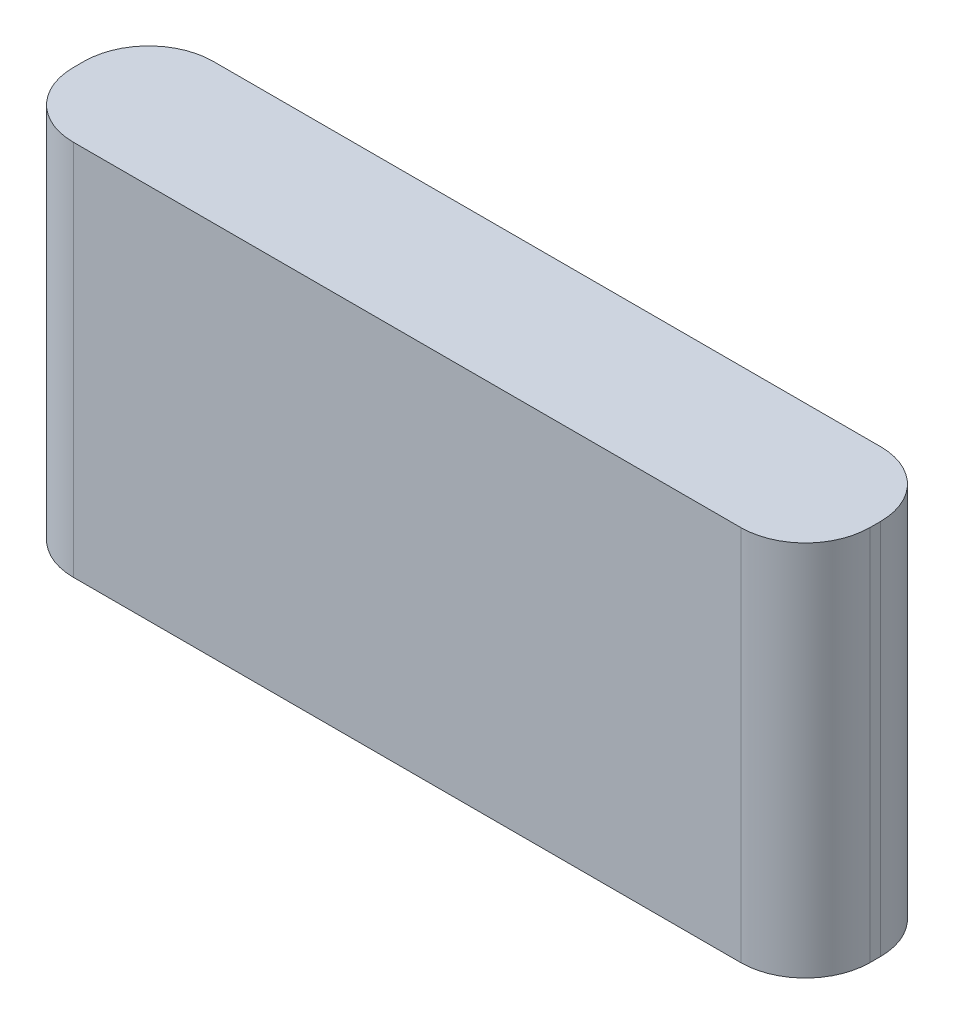
ISO-10303-21;
HEADER;
FILE_DESCRIPTION(('STEP AP214'),'2;1');
FILE_NAME('part.step','',(''),(''),'','','');
FILE_SCHEMA(('AUTOMOTIVE_DESIGN { 1 0 10303 214 1 1 1 1 }'));
ENDSEC;
DATA;
#1=APPLICATION_CONTEXT('core data for automotive mechanical design processes');
#2=APPLICATION_PROTOCOL_DEFINITION('international standard','automotive_design',2000,#1);
#3=PRODUCT_CONTEXT('',#1,'mechanical');
#4=PRODUCT('Part','Part','',(#3));
#5=PRODUCT_RELATED_PRODUCT_CATEGORY('part','',(#4));
#6=PRODUCT_DEFINITION_FORMATION('','',#4);
#7=PRODUCT_DEFINITION_CONTEXT('part definition',#1,'design');
#8=PRODUCT_DEFINITION('design','',#6,#7);
#9=PRODUCT_DEFINITION_SHAPE('','',#8);
#10=(LENGTH_UNIT() NAMED_UNIT(*) SI_UNIT(.MILLI.,.METRE.));
#11=(NAMED_UNIT(*) PLANE_ANGLE_UNIT() SI_UNIT($,.RADIAN.));
#12=(NAMED_UNIT(*) SI_UNIT($,.STERADIAN.) SOLID_ANGLE_UNIT());
#13=UNCERTAINTY_MEASURE_WITH_UNIT(LENGTH_MEASURE(1.E-05),#10,'distance_accuracy_value','');
#14=(GEOMETRIC_REPRESENTATION_CONTEXT(3) GLOBAL_UNCERTAINTY_ASSIGNED_CONTEXT((#13)) GLOBAL_UNIT_ASSIGNED_CONTEXT((#10,
#11,#12)) REPRESENTATION_CONTEXT('',''));
#15=CARTESIAN_POINT('',(0.,0.,0.));
#16=DIRECTION('',(0.,0.,1.));
#17=DIRECTION('',(1.,0.,0.));
#18=AXIS2_PLACEMENT_3D('',#15,#16,#17);
#19=CARTESIAN_POINT('',(37.,17.5,13.));
#20=DIRECTION('',(-1.,0.,0.));
#21=DIRECTION('',(0.,0.,1.));
#22=AXIS2_PLACEMENT_3D('',#19,#20,#21);
#23=PLANE('',#22);
#24=DIRECTION('',(0.,0.,-1.));
#25=VECTOR('',#24,1.);
#26=CARTESIAN_POINT('',(37.,-17.5,13.));
#27=LINE('',#26,#25);
#28=CARTESIAN_POINT('',(37.,-17.5,7.));
#29=VERTEX_POINT('',#28);
#30=CARTESIAN_POINT('',(37.,-17.5,6.));
#31=VERTEX_POINT('',#30);
#32=EDGE_CURVE('E125',#29,#31,#27,.T.);
#33=ORIENTED_EDGE('',*,*,#32,.T.);
#34=DIRECTION('',(0.,1.,0.));
#35=VECTOR('',#34,1.);
#36=CARTESIAN_POINT('',(37.,17.5,6.));
#37=LINE('',#36,#35);
#38=CARTESIAN_POINT('',(37.,17.5,6.));
#39=VERTEX_POINT('',#38);
#40=EDGE_CURVE('E11',#31,#39,#37,.T.);
#41=ORIENTED_EDGE('',*,*,#40,.T.);
#42=DIRECTION('',(0.,0.,-1.));
#43=VECTOR('',#42,1.);
#44=CARTESIAN_POINT('',(37.,17.5,13.));
#45=LINE('',#44,#43);
#46=CARTESIAN_POINT('',(37.,17.5,7.));
#47=VERTEX_POINT('',#46);
#48=EDGE_CURVE('E130',#47,#39,#45,.T.);
#49=ORIENTED_EDGE('',*,*,#48,.F.);
#50=DIRECTION('',(0.,1.,0.));
#51=VECTOR('',#50,1.);
#52=CARTESIAN_POINT('',(37.,-17.5,7.));
#53=LINE('',#52,#51);
#54=EDGE_CURVE('E45',#47,#29,#53,.F.);
#55=ORIENTED_EDGE('',*,*,#54,.T.);
#56=EDGE_LOOP('',(#33,#41,#49,#55));
#57=FACE_BOUND('',#56,.T.);
#58=ADVANCED_FACE('F37',(#57),#23,.F.);
#59=CARTESIAN_POINT('',(-37.,17.5,13.));
#60=DIRECTION('',(0.,-1.,0.));
#61=DIRECTION('',(0.,0.,-1.));
#62=AXIS2_PLACEMENT_3D('',#59,#60,#61);
#63=PLANE('',#62);
#64=DIRECTION('',(-1.,0.,0.));
#65=VECTOR('',#64,1.);
#66=CARTESIAN_POINT('',(-37.,17.5,0.));
#67=LINE('',#66,#65);
#68=CARTESIAN_POINT('',(31.,17.5,0.));
#69=VERTEX_POINT('',#68);
#70=CARTESIAN_POINT('',(-31.,17.5,0.));
#71=VERTEX_POINT('',#70);
#72=EDGE_CURVE('E172',#69,#71,#67,.T.);
#73=ORIENTED_EDGE('',*,*,#72,.T.);
#74=CARTESIAN_POINT('',(-31.,17.5,6.));
#75=DIRECTION('',(0.,-1.,0.));
#76=DIRECTION('',(0.,0.,-1.));
#77=AXIS2_PLACEMENT_3D('',#74,#75,#76);
#78=CIRCLE('',#77,6.);
#79=CARTESIAN_POINT('',(-37.,17.5,6.));
#80=VERTEX_POINT('',#79);
#81=EDGE_CURVE('E147',#71,#80,#78,.F.);
#82=ORIENTED_EDGE('',*,*,#81,.T.);
#83=DIRECTION('',(0.,0.,-1.));
#84=VECTOR('',#83,1.);
#85=CARTESIAN_POINT('',(-37.,17.5,13.));
#86=LINE('',#85,#84);
#87=CARTESIAN_POINT('',(-37.,17.5,7.));
#88=VERTEX_POINT('',#87);
#89=EDGE_CURVE('E124',#88,#80,#86,.T.);
#90=ORIENTED_EDGE('',*,*,#89,.F.);
#91=CARTESIAN_POINT('',(-31.,17.5,7.));
#92=DIRECTION('',(0.,-1.,0.));
#93=DIRECTION('',(0.,0.,-1.));
#94=AXIS2_PLACEMENT_3D('',#91,#92,#93);
#95=CIRCLE('',#94,6.);
#96=CARTESIAN_POINT('',(-31.,17.5,13.));
#97=VERTEX_POINT('',#96);
#98=EDGE_CURVE('E129',#88,#97,#95,.F.);
#99=ORIENTED_EDGE('',*,*,#98,.T.);
#100=DIRECTION('',(-1.,0.,0.));
#101=VECTOR('',#100,1.);
#102=CARTESIAN_POINT('',(-37.,17.5,13.));
#103=LINE('',#102,#101);
#104=CARTESIAN_POINT('',(31.,17.5,13.));
#105=VERTEX_POINT('',#104);
#106=EDGE_CURVE('E166',#105,#97,#103,.T.);
#107=ORIENTED_EDGE('',*,*,#106,.F.);
#108=CARTESIAN_POINT('',(31.,17.5,7.));
#109=DIRECTION('',(0.,-1.,0.));
#110=DIRECTION('',(0.,0.,-1.));
#111=AXIS2_PLACEMENT_3D('',#108,#109,#110);
#112=CIRCLE('',#111,6.);
#113=EDGE_CURVE('E59',#105,#47,#112,.F.);
#114=ORIENTED_EDGE('',*,*,#113,.T.);
#115=ORIENTED_EDGE('',*,*,#48,.T.);
#116=CARTESIAN_POINT('',(31.,17.5,6.));
#117=DIRECTION('',(0.,-1.,0.));
#118=DIRECTION('',(0.,0.,-1.));
#119=AXIS2_PLACEMENT_3D('',#116,#117,#118);
#120=CIRCLE('',#119,6.);
#121=EDGE_CURVE('E52',#39,#69,#120,.F.);
#122=ORIENTED_EDGE('',*,*,#121,.T.);
#123=EDGE_LOOP('',(#73,#82,#90,#99,#107,#114,#115,#122));
#124=FACE_BOUND('',#123,.T.);
#125=ADVANCED_FACE('F168',(#124),#63,.F.);
#126=CARTESIAN_POINT('',(-37.,17.5,13.));
#127=DIRECTION('',(1.,0.,0.));
#128=DIRECTION('',(0.,1.,0.));
#129=AXIS2_PLACEMENT_3D('',#126,#127,#128);
#130=PLANE('',#129);
#131=ORIENTED_EDGE('',*,*,#89,.T.);
#132=DIRECTION('',(0.,-1.,0.));
#133=VECTOR('',#132,1.);
#134=CARTESIAN_POINT('',(-37.,17.5,6.));
#135=LINE('',#134,#133);
#136=CARTESIAN_POINT('',(-37.,-17.5,6.));
#137=VERTEX_POINT('',#136);
#138=EDGE_CURVE('E123',#80,#137,#135,.T.);
#139=ORIENTED_EDGE('',*,*,#138,.T.);
#140=DIRECTION('',(0.,0.,-1.));
#141=VECTOR('',#140,1.);
#142=CARTESIAN_POINT('',(-37.,-17.5,13.));
#143=LINE('',#142,#141);
#144=CARTESIAN_POINT('',(-37.,-17.5,7.));
#145=VERTEX_POINT('',#144);
#146=EDGE_CURVE('E106',#145,#137,#143,.T.);
#147=ORIENTED_EDGE('',*,*,#146,.F.);
#148=DIRECTION('',(0.,-1.,0.));
#149=VECTOR('',#148,1.);
#150=CARTESIAN_POINT('',(-37.,17.5,7.));
#151=LINE('',#150,#149);
#152=EDGE_CURVE('E120',#145,#88,#151,.F.);
#153=ORIENTED_EDGE('',*,*,#152,.T.);
#154=EDGE_LOOP('',(#131,#139,#147,#153));
#155=FACE_BOUND('',#154,.T.);
#156=ADVANCED_FACE('F119',(#155),#130,.F.);
#157=CARTESIAN_POINT('',(-37.,-17.5,13.));
#158=DIRECTION('',(0.,1.,0.));
#159=DIRECTION('',(0.,0.,1.));
#160=AXIS2_PLACEMENT_3D('',#157,#158,#159);
#161=PLANE('',#160);
#162=ORIENTED_EDGE('',*,*,#146,.T.);
#163=CARTESIAN_POINT('',(-31.,-17.5,6.));
#164=DIRECTION('',(0.,1.,0.));
#165=DIRECTION('',(0.,0.,1.));
#166=AXIS2_PLACEMENT_3D('',#163,#164,#165);
#167=CIRCLE('',#166,6.);
#168=CARTESIAN_POINT('',(-31.,-17.5,0.));
#169=VERTEX_POINT('',#168);
#170=EDGE_CURVE('E113',#137,#169,#167,.F.);
#171=ORIENTED_EDGE('',*,*,#170,.T.);
#172=DIRECTION('',(1.,0.,0.));
#173=VECTOR('',#172,1.);
#174=CARTESIAN_POINT('',(-37.,-17.5,0.));
#175=LINE('',#174,#173);
#176=CARTESIAN_POINT('',(31.,-17.5,0.));
#177=VERTEX_POINT('',#176);
#178=EDGE_CURVE('E169',#169,#177,#175,.T.);
#179=ORIENTED_EDGE('',*,*,#178,.T.);
#180=CARTESIAN_POINT('',(31.,-17.5,6.));
#181=DIRECTION('',(0.,1.,0.));
#182=DIRECTION('',(0.,0.,1.));
#183=AXIS2_PLACEMENT_3D('',#180,#181,#182);
#184=CIRCLE('',#183,6.);
#185=EDGE_CURVE('E114',#177,#31,#184,.F.);
#186=ORIENTED_EDGE('',*,*,#185,.T.);
#187=ORIENTED_EDGE('',*,*,#32,.F.);
#188=CARTESIAN_POINT('',(31.,-17.5,7.));
#189=DIRECTION('',(0.,1.,0.));
#190=DIRECTION('',(0.,0.,1.));
#191=AXIS2_PLACEMENT_3D('',#188,#189,#190);
#192=CIRCLE('',#191,6.);
#193=CARTESIAN_POINT('',(31.,-17.5,13.));
#194=VERTEX_POINT('',#193);
#195=EDGE_CURVE('E132',#29,#194,#192,.F.);
#196=ORIENTED_EDGE('',*,*,#195,.T.);
#197=DIRECTION('',(1.,0.,0.));
#198=VECTOR('',#197,1.);
#199=CARTESIAN_POINT('',(-37.,-17.5,13.));
#200=LINE('',#199,#198);
#201=CARTESIAN_POINT('',(-31.,-17.5,13.));
#202=VERTEX_POINT('',#201);
#203=EDGE_CURVE('E108',#202,#194,#200,.T.);
#204=ORIENTED_EDGE('',*,*,#203,.F.);
#205=CARTESIAN_POINT('',(-31.,-17.5,7.));
#206=DIRECTION('',(0.,1.,0.));
#207=DIRECTION('',(0.,0.,1.));
#208=AXIS2_PLACEMENT_3D('',#205,#206,#207);
#209=CIRCLE('',#208,6.);
#210=EDGE_CURVE('E103',#202,#145,#209,.F.);
#211=ORIENTED_EDGE('',*,*,#210,.T.);
#212=EDGE_LOOP('',(#162,#171,#179,#186,#187,#196,#204,#211));
#213=FACE_BOUND('',#212,.T.);
#214=ADVANCED_FACE('F105',(#213),#161,.F.);
#215=CARTESIAN_POINT('',(0.,0.,13.));
#216=DIRECTION('',(0.,0.,1.));
#217=DIRECTION('',(1.,0.,0.));
#218=AXIS2_PLACEMENT_3D('',#215,#216,#217);
#219=PLANE('',#218);
#220=ORIENTED_EDGE('',*,*,#106,.T.);
#221=DIRECTION('',(0.,-1.,0.));
#222=VECTOR('',#221,1.);
#223=CARTESIAN_POINT('',(-31.,-17.5,13.));
#224=LINE('',#223,#222);
#225=EDGE_CURVE('E152',#97,#202,#224,.T.);
#226=ORIENTED_EDGE('',*,*,#225,.T.);
#227=ORIENTED_EDGE('',*,*,#203,.T.);
#228=DIRECTION('',(0.,1.,0.));
#229=VECTOR('',#228,1.);
#230=CARTESIAN_POINT('',(31.,17.5,13.));
#231=LINE('',#230,#229);
#232=EDGE_CURVE('E149',#194,#105,#231,.T.);
#233=ORIENTED_EDGE('',*,*,#232,.T.);
#234=EDGE_LOOP('',(#220,#226,#227,#233));
#235=FACE_BOUND('',#234,.T.);
#236=ADVANCED_FACE('F165',(#235),#219,.T.);
#237=CARTESIAN_POINT('',(0.,0.,0.));
#238=DIRECTION('',(0.,0.,1.));
#239=DIRECTION('',(1.,0.,0.));
#240=AXIS2_PLACEMENT_3D('',#237,#238,#239);
#241=PLANE('',#240);
#242=ORIENTED_EDGE('',*,*,#178,.F.);
#243=DIRECTION('',(0.,-1.,0.));
#244=VECTOR('',#243,1.);
#245=CARTESIAN_POINT('',(-31.,0.,0.));
#246=LINE('',#245,#244);
#247=EDGE_CURVE('E142',#169,#71,#246,.F.);
#248=ORIENTED_EDGE('',*,*,#247,.T.);
#249=ORIENTED_EDGE('',*,*,#72,.F.);
#250=DIRECTION('',(0.,1.,0.));
#251=VECTOR('',#250,1.);
#252=CARTESIAN_POINT('',(31.,0.,0.));
#253=LINE('',#252,#251);
#254=EDGE_CURVE('E140',#69,#177,#253,.F.);
#255=ORIENTED_EDGE('',*,*,#254,.T.);
#256=EDGE_LOOP('',(#242,#248,#249,#255));
#257=FACE_BOUND('',#256,.T.);
#258=ADVANCED_FACE('F181',(#257),#241,.F.);
#259=CARTESIAN_POINT('',(-31.,17.5,6.));
#260=DIRECTION('',(0.,-1.,0.));
#261=DIRECTION('',(1.,0.,0.));
#262=AXIS2_PLACEMENT_3D('',#259,#260,#261);
#263=CYLINDRICAL_SURFACE('',#262,6.);
#264=ORIENTED_EDGE('',*,*,#81,.F.);
#265=ORIENTED_EDGE('',*,*,#247,.F.);
#266=ORIENTED_EDGE('',*,*,#170,.F.);
#267=ORIENTED_EDGE('',*,*,#138,.F.);
#268=EDGE_LOOP('',(#264,#265,#266,#267));
#269=FACE_BOUND('',#268,.T.);
#270=ADVANCED_FACE('F177',(#269),#263,.T.);
#271=CARTESIAN_POINT('',(-31.,0.,7.));
#272=DIRECTION('',(0.,1.,0.));
#273=DIRECTION('',(-1.,0.,0.));
#274=AXIS2_PLACEMENT_3D('',#271,#272,#273);
#275=CYLINDRICAL_SURFACE('',#274,6.);
#276=ORIENTED_EDGE('',*,*,#98,.F.);
#277=ORIENTED_EDGE('',*,*,#152,.F.);
#278=ORIENTED_EDGE('',*,*,#210,.F.);
#279=ORIENTED_EDGE('',*,*,#225,.F.);
#280=EDGE_LOOP('',(#276,#277,#278,#279));
#281=FACE_BOUND('',#280,.T.);
#282=ADVANCED_FACE('F128',(#281),#275,.T.);
#283=CARTESIAN_POINT('',(31.,17.5,6.));
#284=DIRECTION('',(0.,1.,0.));
#285=DIRECTION('',(0.,0.,1.));
#286=AXIS2_PLACEMENT_3D('',#283,#284,#285);
#287=CYLINDRICAL_SURFACE('',#286,6.);
#288=ORIENTED_EDGE('',*,*,#185,.F.);
#289=ORIENTED_EDGE('',*,*,#254,.F.);
#290=ORIENTED_EDGE('',*,*,#121,.F.);
#291=ORIENTED_EDGE('',*,*,#40,.F.);
#292=EDGE_LOOP('',(#288,#289,#290,#291));
#293=FACE_BOUND('',#292,.T.);
#294=ADVANCED_FACE('F183',(#293),#287,.T.);
#295=CARTESIAN_POINT('',(31.,0.,7.));
#296=DIRECTION('',(0.,-1.,0.));
#297=DIRECTION('',(0.,0.,-1.));
#298=AXIS2_PLACEMENT_3D('',#295,#296,#297);
#299=CYLINDRICAL_SURFACE('',#298,6.);
#300=ORIENTED_EDGE('',*,*,#195,.F.);
#301=ORIENTED_EDGE('',*,*,#54,.F.);
#302=ORIENTED_EDGE('',*,*,#113,.F.);
#303=ORIENTED_EDGE('',*,*,#232,.F.);
#304=EDGE_LOOP('',(#300,#301,#302,#303));
#305=FACE_BOUND('',#304,.T.);
#306=ADVANCED_FACE('F39',(#305),#299,.T.);
#307=CLOSED_SHELL('',(#58,#125,#156,#214,#236,#258,#270,#282,#294,#306));
#308=MANIFOLD_SOLID_BREP('B2',#307);
#309=ADVANCED_BREP_SHAPE_REPRESENTATION('',(#18,#308),#14);
#310=SHAPE_DEFINITION_REPRESENTATION(#9,#309);
ENDSEC;
END-ISO-10303-21;
